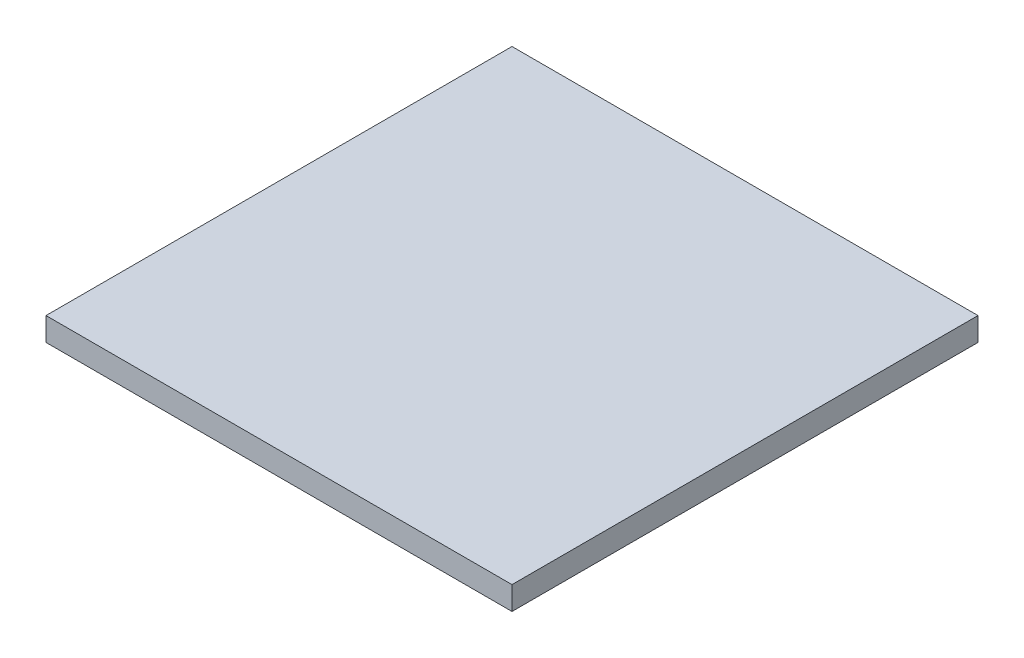
ISO-10303-21;
HEADER;
FILE_DESCRIPTION(('STEP AP214'),'2;1');
FILE_NAME('part.step','',(''),(''),'','','');
FILE_SCHEMA(('AUTOMOTIVE_DESIGN { 1 0 10303 214 1 1 1 1 }'));
ENDSEC;
DATA;
#1=APPLICATION_CONTEXT('core data for automotive mechanical design processes');
#2=APPLICATION_PROTOCOL_DEFINITION('international standard','automotive_design',2000,#1);
#3=PRODUCT_CONTEXT('',#1,'mechanical');
#4=PRODUCT('Part','Part','',(#3));
#5=PRODUCT_RELATED_PRODUCT_CATEGORY('part','',(#4));
#6=PRODUCT_DEFINITION_FORMATION('','',#4);
#7=PRODUCT_DEFINITION_CONTEXT('part definition',#1,'design');
#8=PRODUCT_DEFINITION('design','',#6,#7);
#9=PRODUCT_DEFINITION_SHAPE('','',#8);
#10=(LENGTH_UNIT() NAMED_UNIT(*) SI_UNIT(.MILLI.,.METRE.));
#11=(NAMED_UNIT(*) PLANE_ANGLE_UNIT() SI_UNIT($,.RADIAN.));
#12=(NAMED_UNIT(*) SI_UNIT($,.STERADIAN.) SOLID_ANGLE_UNIT());
#13=UNCERTAINTY_MEASURE_WITH_UNIT(LENGTH_MEASURE(1.E-05),#10,'distance_accuracy_value','');
#14=(GEOMETRIC_REPRESENTATION_CONTEXT(3) GLOBAL_UNCERTAINTY_ASSIGNED_CONTEXT((#13)) GLOBAL_UNIT_ASSIGNED_CONTEXT((#10,
#11,#12)) REPRESENTATION_CONTEXT('',''));
#15=CARTESIAN_POINT('',(0.,0.,0.));
#16=DIRECTION('',(0.,0.,1.));
#17=DIRECTION('',(1.,0.,0.));
#18=AXIS2_PLACEMENT_3D('',#15,#16,#17);
#19=CARTESIAN_POINT('',(0.,4.,0.));
#20=DIRECTION('',(1.,0.,0.));
#21=DIRECTION('',(0.,0.,-1.));
#22=AXIS2_PLACEMENT_3D('',#19,#20,#21);
#23=PLANE('',#22);
#24=DIRECTION('',(0.,0.,1.));
#25=VECTOR('',#24,1.);
#26=CARTESIAN_POINT('',(0.,0.,0.));
#27=LINE('',#26,#25);
#28=CARTESIAN_POINT('',(0.,0.,-80.));
#29=VERTEX_POINT('',#28);
#30=CARTESIAN_POINT('',(0.,0.,0.));
#31=VERTEX_POINT('',#30);
#32=EDGE_CURVE('E100',#29,#31,#27,.T.);
#33=ORIENTED_EDGE('',*,*,#32,.T.);
#34=DIRECTION('',(0.,-1.,0.));
#35=VECTOR('',#34,1.);
#36=CARTESIAN_POINT('',(0.,4.,0.));
#37=LINE('',#36,#35);
#38=CARTESIAN_POINT('',(0.,4.,0.));
#39=VERTEX_POINT('',#38);
#40=EDGE_CURVE('E11',#39,#31,#37,.T.);
#41=ORIENTED_EDGE('',*,*,#40,.F.);
#42=DIRECTION('',(0.,0.,1.));
#43=VECTOR('',#42,1.);
#44=CARTESIAN_POINT('',(0.,4.,0.));
#45=LINE('',#44,#43);
#46=CARTESIAN_POINT('',(0.,4.,-80.));
#47=VERTEX_POINT('',#46);
#48=EDGE_CURVE('E88',#47,#39,#45,.T.);
#49=ORIENTED_EDGE('',*,*,#48,.F.);
#50=DIRECTION('',(0.,-1.,0.));
#51=VECTOR('',#50,1.);
#52=CARTESIAN_POINT('',(0.,4.,-80.));
#53=LINE('',#52,#51);
#54=EDGE_CURVE('E96',#47,#29,#53,.T.);
#55=ORIENTED_EDGE('',*,*,#54,.T.);
#56=EDGE_LOOP('',(#33,#41,#49,#55));
#57=FACE_BOUND('',#56,.T.);
#58=ADVANCED_FACE('F37',(#57),#23,.F.);
#59=CARTESIAN_POINT('',(0.,4.,0.));
#60=DIRECTION('',(0.,0.,-1.));
#61=DIRECTION('',(-1.,0.,0.));
#62=AXIS2_PLACEMENT_3D('',#59,#60,#61);
#63=PLANE('',#62);
#64=DIRECTION('',(1.,0.,0.));
#65=VECTOR('',#64,1.);
#66=CARTESIAN_POINT('',(0.,0.,0.));
#67=LINE('',#66,#65);
#68=CARTESIAN_POINT('',(80.,0.,0.));
#69=VERTEX_POINT('',#68);
#70=EDGE_CURVE('E92',#31,#69,#67,.T.);
#71=ORIENTED_EDGE('',*,*,#70,.T.);
#72=DIRECTION('',(0.,-1.,0.));
#73=VECTOR('',#72,1.);
#74=CARTESIAN_POINT('',(80.,4.,0.));
#75=LINE('',#74,#73);
#76=CARTESIAN_POINT('',(80.,4.,0.));
#77=VERTEX_POINT('',#76);
#78=EDGE_CURVE('E45',#77,#69,#75,.T.);
#79=ORIENTED_EDGE('',*,*,#78,.F.);
#80=DIRECTION('',(1.,0.,0.));
#81=VECTOR('',#80,1.);
#82=CARTESIAN_POINT('',(0.,4.,0.));
#83=LINE('',#82,#81);
#84=EDGE_CURVE('E83',#39,#77,#83,.T.);
#85=ORIENTED_EDGE('',*,*,#84,.F.);
#86=ORIENTED_EDGE('',*,*,#40,.T.);
#87=EDGE_LOOP('',(#71,#79,#85,#86));
#88=FACE_BOUND('',#87,.T.);
#89=ADVANCED_FACE('F91',(#88),#63,.F.);
#90=CARTESIAN_POINT('',(80.,4.,0.));
#91=DIRECTION('',(-1.,0.,0.));
#92=DIRECTION('',(0.,0.,1.));
#93=AXIS2_PLACEMENT_3D('',#90,#91,#92);
#94=PLANE('',#93);
#95=DIRECTION('',(0.,0.,-1.));
#96=VECTOR('',#95,1.);
#97=CARTESIAN_POINT('',(80.,0.,0.));
#98=LINE('',#97,#96);
#99=CARTESIAN_POINT('',(80.,0.,-80.));
#100=VERTEX_POINT('',#99);
#101=EDGE_CURVE('E70',#69,#100,#98,.T.);
#102=ORIENTED_EDGE('',*,*,#101,.T.);
#103=DIRECTION('',(0.,-1.,0.));
#104=VECTOR('',#103,1.);
#105=CARTESIAN_POINT('',(80.,4.,-80.));
#106=LINE('',#105,#104);
#107=CARTESIAN_POINT('',(80.,4.,-80.));
#108=VERTEX_POINT('',#107);
#109=EDGE_CURVE('E93',#108,#100,#106,.T.);
#110=ORIENTED_EDGE('',*,*,#109,.F.);
#111=DIRECTION('',(0.,0.,-1.));
#112=VECTOR('',#111,1.);
#113=CARTESIAN_POINT('',(80.,4.,0.));
#114=LINE('',#113,#112);
#115=EDGE_CURVE('E86',#77,#108,#114,.T.);
#116=ORIENTED_EDGE('',*,*,#115,.F.);
#117=ORIENTED_EDGE('',*,*,#78,.T.);
#118=EDGE_LOOP('',(#102,#110,#116,#117));
#119=FACE_BOUND('',#118,.T.);
#120=ADVANCED_FACE('F94',(#119),#94,.F.);
#121=CARTESIAN_POINT('',(0.,4.,-80.));
#122=DIRECTION('',(0.,0.,1.));
#123=DIRECTION('',(1.,0.,0.));
#124=AXIS2_PLACEMENT_3D('',#121,#122,#123);
#125=PLANE('',#124);
#126=DIRECTION('',(-1.,0.,0.));
#127=VECTOR('',#126,1.);
#128=CARTESIAN_POINT('',(0.,0.,-80.));
#129=LINE('',#128,#127);
#130=EDGE_CURVE('E76',#100,#29,#129,.T.);
#131=ORIENTED_EDGE('',*,*,#130,.T.);
#132=ORIENTED_EDGE('',*,*,#54,.F.);
#133=DIRECTION('',(-1.,0.,0.));
#134=VECTOR('',#133,1.);
#135=CARTESIAN_POINT('',(0.,4.,-80.));
#136=LINE('',#135,#134);
#137=EDGE_CURVE('E53',#108,#47,#136,.T.);
#138=ORIENTED_EDGE('',*,*,#137,.F.);
#139=ORIENTED_EDGE('',*,*,#109,.T.);
#140=EDGE_LOOP('',(#131,#132,#138,#139));
#141=FACE_BOUND('',#140,.T.);
#142=ADVANCED_FACE('F107',(#141),#125,.F.);
#143=CARTESIAN_POINT('',(0.,4.,0.));
#144=DIRECTION('',(0.,-1.,0.));
#145=DIRECTION('',(0.,0.,-1.));
#146=AXIS2_PLACEMENT_3D('',#143,#144,#145);
#147=PLANE('',#146);
#148=ORIENTED_EDGE('',*,*,#48,.T.);
#149=ORIENTED_EDGE('',*,*,#84,.T.);
#150=ORIENTED_EDGE('',*,*,#115,.T.);
#151=ORIENTED_EDGE('',*,*,#137,.T.);
#152=EDGE_LOOP('',(#148,#149,#150,#151));
#153=FACE_BOUND('',#152,.T.);
#154=ADVANCED_FACE('F84',(#153),#147,.F.);
#155=CARTESIAN_POINT('',(0.,0.,0.));
#156=DIRECTION('',(0.,-1.,0.));
#157=DIRECTION('',(0.,0.,-1.));
#158=AXIS2_PLACEMENT_3D('',#155,#156,#157);
#159=PLANE('',#158);
#160=ORIENTED_EDGE('',*,*,#32,.F.);
#161=ORIENTED_EDGE('',*,*,#130,.F.);
#162=ORIENTED_EDGE('',*,*,#101,.F.);
#163=ORIENTED_EDGE('',*,*,#70,.F.);
#164=EDGE_LOOP('',(#160,#161,#162,#163));
#165=FACE_BOUND('',#164,.T.);
#166=ADVANCED_FACE('F110',(#165),#159,.T.);
#167=CLOSED_SHELL('',(#58,#89,#120,#142,#154,#166));
#168=MANIFOLD_SOLID_BREP('B2',#167);
#169=ADVANCED_BREP_SHAPE_REPRESENTATION('',(#18,#168),#14);
#170=SHAPE_DEFINITION_REPRESENTATION(#9,#169);
ENDSEC;
END-ISO-10303-21;
